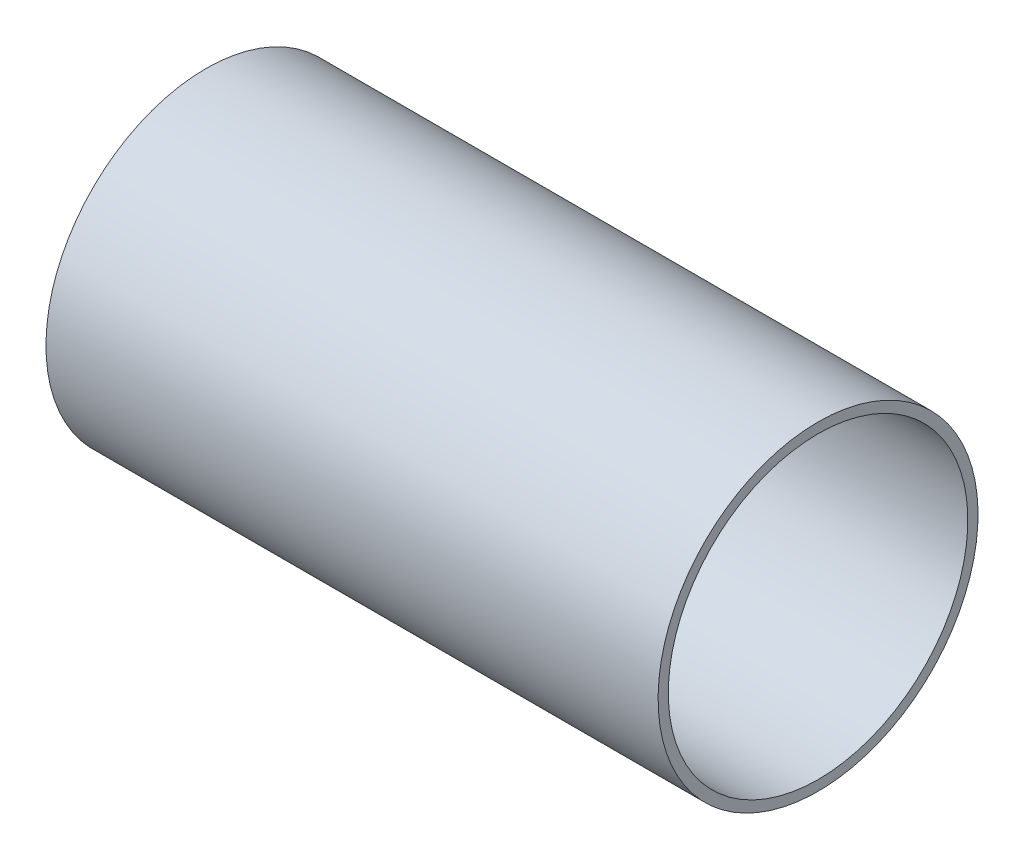
ISO-10303-21;
HEADER;
FILE_DESCRIPTION(('STEP AP214'),'2;1');
FILE_NAME('part.step','',(''),(''),'','','');
FILE_SCHEMA(('AUTOMOTIVE_DESIGN { 1 0 10303 214 1 1 1 1 }'));
ENDSEC;
DATA;
#1=APPLICATION_CONTEXT('core data for automotive mechanical design processes');
#2=APPLICATION_PROTOCOL_DEFINITION('international standard','automotive_design',2000,#1);
#3=PRODUCT_CONTEXT('',#1,'mechanical');
#4=PRODUCT('Part','Part','',(#3));
#5=PRODUCT_RELATED_PRODUCT_CATEGORY('part','',(#4));
#6=PRODUCT_DEFINITION_FORMATION('','',#4);
#7=PRODUCT_DEFINITION_CONTEXT('part definition',#1,'design');
#8=PRODUCT_DEFINITION('design','',#6,#7);
#9=PRODUCT_DEFINITION_SHAPE('','',#8);
#10=(LENGTH_UNIT() NAMED_UNIT(*) SI_UNIT(.MILLI.,.METRE.));
#11=(NAMED_UNIT(*) PLANE_ANGLE_UNIT() SI_UNIT($,.RADIAN.));
#12=(NAMED_UNIT(*) SI_UNIT($,.STERADIAN.) SOLID_ANGLE_UNIT());
#13=UNCERTAINTY_MEASURE_WITH_UNIT(LENGTH_MEASURE(1.E-05),#10,'distance_accuracy_value','');
#14=(GEOMETRIC_REPRESENTATION_CONTEXT(3) GLOBAL_UNCERTAINTY_ASSIGNED_CONTEXT((#13)) GLOBAL_UNIT_ASSIGNED_CONTEXT((#10,
#11,#12)) REPRESENTATION_CONTEXT('',''));
#15=CARTESIAN_POINT('',(0.,0.,0.));
#16=DIRECTION('',(0.,0.,1.));
#17=DIRECTION('',(1.,0.,0.));
#18=AXIS2_PLACEMENT_3D('',#15,#16,#17);
#19=CARTESIAN_POINT('',(507.999999999505,0.,0.));
#20=DIRECTION('',(-1.,0.,0.));
#21=DIRECTION('',(0.,-1.,0.));
#22=AXIS2_PLACEMENT_3D('',#19,#20,#21);
#23=CYLINDRICAL_SURFACE('',#22,49.784);
#24=CARTESIAN_POINT('',(317.499999999505,0.,0.));
#25=DIRECTION('',(1.,0.,0.));
#26=DIRECTION('',(0.,1.,0.));
#27=AXIS2_PLACEMENT_3D('',#24,#25,#26);
#28=CIRCLE('',#27,49.784);
#29=CARTESIAN_POINT('',(317.499999999505,49.784,0.));
#30=VERTEX_POINT('',#29);
#31=EDGE_CURVE('E43',#30,#30,#28,.T.);
#32=ORIENTED_EDGE('',*,*,#31,.T.);
#33=EDGE_LOOP('',(#32));
#34=FACE_BOUND('',#33,.T.);
#35=CARTESIAN_POINT('',(507.999999999505,0.,0.));
#36=DIRECTION('',(1.,0.,0.));
#37=DIRECTION('',(0.,1.,0.));
#38=AXIS2_PLACEMENT_3D('',#35,#36,#37);
#39=CIRCLE('',#38,49.784);
#40=CARTESIAN_POINT('',(507.999999999505,49.784,0.));
#41=VERTEX_POINT('',#40);
#42=EDGE_CURVE('E10',#41,#41,#39,.T.);
#43=ORIENTED_EDGE('',*,*,#42,.F.);
#44=EDGE_LOOP('',(#43));
#45=FACE_BOUND('',#44,.T.);
#46=ADVANCED_FACE('F40',(#34,#45),#23,.T.);
#47=CARTESIAN_POINT('',(507.999999999505,0.,0.));
#48=DIRECTION('',(1.,0.,0.));
#49=DIRECTION('',(0.,1.,0.));
#50=AXIS2_PLACEMENT_3D('',#47,#48,#49);
#51=PLANE('',#50);
#52=CARTESIAN_POINT('',(507.999999999505,0.,0.));
#53=DIRECTION('',(1.,0.,0.));
#54=DIRECTION('',(0.,1.,0.));
#55=AXIS2_PLACEMENT_3D('',#52,#53,#54);
#56=CIRCLE('',#55,46.609);
#57=CARTESIAN_POINT('',(507.999999999505,46.609,0.));
#58=VERTEX_POINT('',#57);
#59=EDGE_CURVE('E52',#58,#58,#56,.T.);
#60=ORIENTED_EDGE('',*,*,#59,.F.);
#61=EDGE_LOOP('',(#60));
#62=FACE_BOUND('',#61,.T.);
#63=ORIENTED_EDGE('',*,*,#42,.T.);
#64=EDGE_LOOP('',(#63));
#65=FACE_BOUND('',#64,.T.);
#66=ADVANCED_FACE('F71',(#62,#65),#51,.T.);
#67=CARTESIAN_POINT('',(317.499999999505,0.,0.));
#68=DIRECTION('',(1.,0.,0.));
#69=DIRECTION('',(0.,1.,0.));
#70=AXIS2_PLACEMENT_3D('',#67,#68,#69);
#71=PLANE('',#70);
#72=CARTESIAN_POINT('',(317.499999999505,0.,0.));
#73=DIRECTION('',(1.,0.,0.));
#74=DIRECTION('',(0.,1.,0.));
#75=AXIS2_PLACEMENT_3D('',#72,#73,#74);
#76=CIRCLE('',#75,46.609);
#77=CARTESIAN_POINT('',(317.499999999505,46.609,0.));
#78=VERTEX_POINT('',#77);
#79=EDGE_CURVE('E57',#78,#78,#76,.T.);
#80=ORIENTED_EDGE('',*,*,#79,.T.);
#81=EDGE_LOOP('',(#80));
#82=FACE_BOUND('',#81,.T.);
#83=ORIENTED_EDGE('',*,*,#31,.F.);
#84=EDGE_LOOP('',(#83));
#85=FACE_BOUND('',#84,.T.);
#86=ADVANCED_FACE('F62',(#82,#85),#71,.F.);
#87=CARTESIAN_POINT('',(507.999999999505,0.,0.));
#88=DIRECTION('',(-1.,0.,0.));
#89=DIRECTION('',(0.,-1.,0.));
#90=AXIS2_PLACEMENT_3D('',#87,#88,#89);
#91=CYLINDRICAL_SURFACE('',#90,46.609);
#92=ORIENTED_EDGE('',*,*,#79,.F.);
#93=EDGE_LOOP('',(#92));
#94=FACE_BOUND('',#93,.T.);
#95=ORIENTED_EDGE('',*,*,#59,.T.);
#96=EDGE_LOOP('',(#95));
#97=FACE_BOUND('',#96,.T.);
#98=ADVANCED_FACE('F65',(#94,#97),#91,.F.);
#99=CLOSED_SHELL('',(#46,#66,#86,#98));
#100=MANIFOLD_SOLID_BREP('B2',#99);
#101=ADVANCED_BREP_SHAPE_REPRESENTATION('',(#18,#100),#14);
#102=SHAPE_DEFINITION_REPRESENTATION(#9,#101);
ENDSEC;
END-ISO-10303-21;
